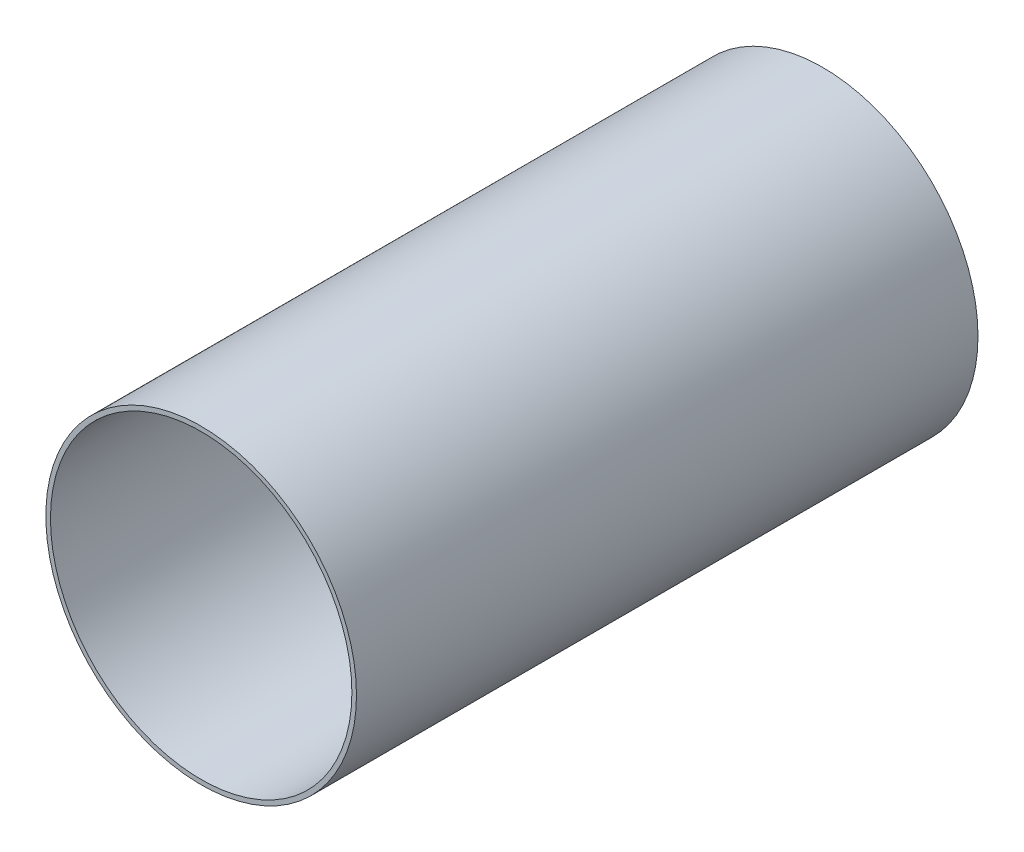
ISO-10303-21;
HEADER;
FILE_DESCRIPTION(('STEP AP214'),'2;1');
FILE_NAME('part.step','',(''),(''),'','','');
FILE_SCHEMA(('AUTOMOTIVE_DESIGN { 1 0 10303 214 1 1 1 1 }'));
ENDSEC;
DATA;
#1=APPLICATION_CONTEXT('core data for automotive mechanical design processes');
#2=APPLICATION_PROTOCOL_DEFINITION('international standard','automotive_design',2000,#1);
#3=PRODUCT_CONTEXT('',#1,'mechanical');
#4=PRODUCT('Part','Part','',(#3));
#5=PRODUCT_RELATED_PRODUCT_CATEGORY('part','',(#4));
#6=PRODUCT_DEFINITION_FORMATION('','',#4);
#7=PRODUCT_DEFINITION_CONTEXT('part definition',#1,'design');
#8=PRODUCT_DEFINITION('design','',#6,#7);
#9=PRODUCT_DEFINITION_SHAPE('','',#8);
#10=(LENGTH_UNIT() NAMED_UNIT(*) SI_UNIT(.MILLI.,.METRE.));
#11=(NAMED_UNIT(*) PLANE_ANGLE_UNIT() SI_UNIT($,.RADIAN.));
#12=(NAMED_UNIT(*) SI_UNIT($,.STERADIAN.) SOLID_ANGLE_UNIT());
#13=UNCERTAINTY_MEASURE_WITH_UNIT(LENGTH_MEASURE(1.E-05),#10,'distance_accuracy_value','');
#14=(GEOMETRIC_REPRESENTATION_CONTEXT(3) GLOBAL_UNCERTAINTY_ASSIGNED_CONTEXT((#13)) GLOBAL_UNIT_ASSIGNED_CONTEXT((#10,
#11,#12)) REPRESENTATION_CONTEXT('',''));
#15=CARTESIAN_POINT('',(0.,0.,0.));
#16=DIRECTION('',(0.,0.,1.));
#17=DIRECTION('',(1.,0.,0.));
#18=AXIS2_PLACEMENT_3D('',#15,#16,#17);
#19=CARTESIAN_POINT('',(0.,0.,127.));
#20=DIRECTION('',(0.,0.,1.));
#21=DIRECTION('',(1.,0.,0.));
#22=AXIS2_PLACEMENT_3D('',#19,#20,#21);
#23=PLANE('',#22);
#24=CARTESIAN_POINT('',(0.,0.,127.));
#25=DIRECTION('',(0.,0.,1.));
#26=DIRECTION('',(1.,0.,0.));
#27=AXIS2_PLACEMENT_3D('',#24,#25,#26);
#28=CIRCLE('',#27,63.4746);
#29=CARTESIAN_POINT('',(63.4746,0.,127.));
#30=VERTEX_POINT('',#29);
#31=EDGE_CURVE('E10',#30,#30,#28,.T.);
#32=ORIENTED_EDGE('',*,*,#31,.T.);
#33=EDGE_LOOP('',(#32));
#34=FACE_BOUND('',#33,.T.);
#35=CARTESIAN_POINT('',(0.,0.,127.));
#36=DIRECTION('',(0.,0.,1.));
#37=DIRECTION('',(1.,0.,0.));
#38=AXIS2_PLACEMENT_3D('',#35,#36,#37);
#39=CIRCLE('',#38,61.595);
#40=CARTESIAN_POINT('',(61.595,0.,127.));
#41=VERTEX_POINT('',#40);
#42=EDGE_CURVE('E54',#41,#41,#39,.T.);
#43=ORIENTED_EDGE('',*,*,#42,.F.);
#44=EDGE_LOOP('',(#43));
#45=FACE_BOUND('',#44,.T.);
#46=ADVANCED_FACE('F43',(#34,#45),#23,.T.);
#47=CARTESIAN_POINT('',(0.,0.,-127.));
#48=DIRECTION('',(0.,0.,1.));
#49=DIRECTION('',(1.,0.,0.));
#50=AXIS2_PLACEMENT_3D('',#47,#48,#49);
#51=PLANE('',#50);
#52=CARTESIAN_POINT('',(0.,0.,-127.));
#53=DIRECTION('',(0.,0.,1.));
#54=DIRECTION('',(1.,0.,0.));
#55=AXIS2_PLACEMENT_3D('',#52,#53,#54);
#56=CIRCLE('',#55,63.4746);
#57=CARTESIAN_POINT('',(63.4746,0.,-127.));
#58=VERTEX_POINT('',#57);
#59=EDGE_CURVE('E47',#58,#58,#56,.T.);
#60=ORIENTED_EDGE('',*,*,#59,.F.);
#61=EDGE_LOOP('',(#60));
#62=FACE_BOUND('',#61,.T.);
#63=CARTESIAN_POINT('',(0.,0.,-127.));
#64=DIRECTION('',(0.,0.,1.));
#65=DIRECTION('',(1.,0.,0.));
#66=AXIS2_PLACEMENT_3D('',#63,#64,#65);
#67=CIRCLE('',#66,61.595);
#68=CARTESIAN_POINT('',(61.595,0.,-127.));
#69=VERTEX_POINT('',#68);
#70=EDGE_CURVE('E56',#69,#69,#67,.T.);
#71=ORIENTED_EDGE('',*,*,#70,.T.);
#72=EDGE_LOOP('',(#71));
#73=FACE_BOUND('',#72,.T.);
#74=ADVANCED_FACE('F66',(#62,#73),#51,.F.);
#75=CARTESIAN_POINT('',(0.,0.,127.));
#76=DIRECTION('',(0.,0.,-1.));
#77=DIRECTION('',(-1.,0.,0.));
#78=AXIS2_PLACEMENT_3D('',#75,#76,#77);
#79=CYLINDRICAL_SURFACE('',#78,63.4746);
#80=ORIENTED_EDGE('',*,*,#31,.F.);
#81=EDGE_LOOP('',(#80));
#82=FACE_BOUND('',#81,.T.);
#83=ORIENTED_EDGE('',*,*,#59,.T.);
#84=EDGE_LOOP('',(#83));
#85=FACE_BOUND('',#84,.T.);
#86=ADVANCED_FACE('F45',(#82,#85),#79,.T.);
#87=CARTESIAN_POINT('',(0.,0.,127.));
#88=DIRECTION('',(0.,0.,-1.));
#89=DIRECTION('',(-1.,0.,0.));
#90=AXIS2_PLACEMENT_3D('',#87,#88,#89);
#91=CYLINDRICAL_SURFACE('',#90,61.595);
#92=ORIENTED_EDGE('',*,*,#42,.T.);
#93=EDGE_LOOP('',(#92));
#94=FACE_BOUND('',#93,.T.);
#95=ORIENTED_EDGE('',*,*,#70,.F.);
#96=EDGE_LOOP('',(#95));
#97=FACE_BOUND('',#96,.T.);
#98=ADVANCED_FACE('F62',(#94,#97),#91,.F.);
#99=CLOSED_SHELL('',(#46,#74,#86,#98));
#100=MANIFOLD_SOLID_BREP('B2',#99);
#101=ADVANCED_BREP_SHAPE_REPRESENTATION('',(#18,#100),#14);
#102=SHAPE_DEFINITION_REPRESENTATION(#9,#101);
ENDSEC;
END-ISO-10303-21;
